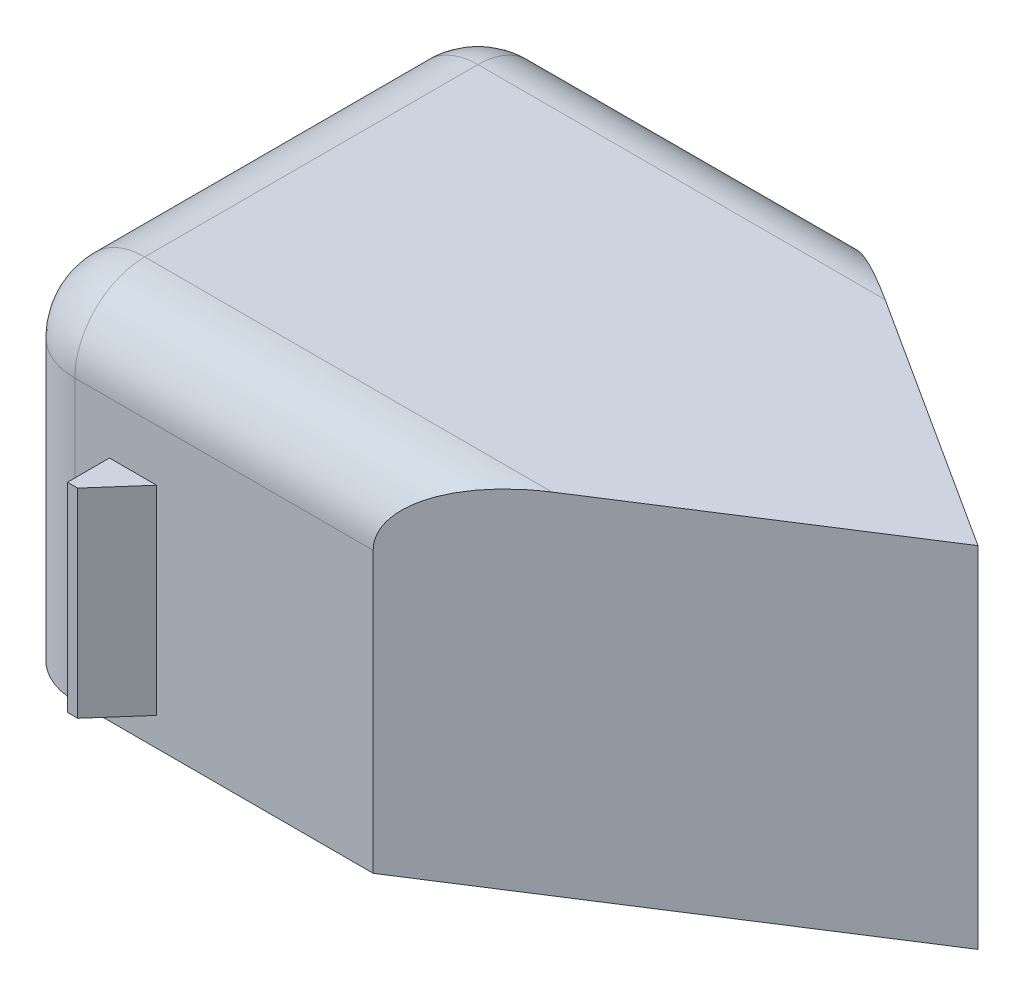
ISO-10303-21;
HEADER;
FILE_DESCRIPTION(('STEP AP214'),'2;1');
FILE_NAME('part.step','',(''),(''),'','','');
FILE_SCHEMA(('AUTOMOTIVE_DESIGN { 1 0 10303 214 1 1 1 1 }'));
ENDSEC;
DATA;
#1=APPLICATION_CONTEXT('core data for automotive mechanical design processes');
#2=APPLICATION_PROTOCOL_DEFINITION('international standard','automotive_design',2000,#1);
#3=PRODUCT_CONTEXT('',#1,'mechanical');
#4=PRODUCT('Part','Part','',(#3));
#5=PRODUCT_RELATED_PRODUCT_CATEGORY('part','',(#4));
#6=PRODUCT_DEFINITION_FORMATION('','',#4);
#7=PRODUCT_DEFINITION_CONTEXT('part definition',#1,'design');
#8=PRODUCT_DEFINITION('design','',#6,#7);
#9=PRODUCT_DEFINITION_SHAPE('','',#8);
#10=(LENGTH_UNIT() NAMED_UNIT(*) SI_UNIT(.MILLI.,.METRE.));
#11=(NAMED_UNIT(*) PLANE_ANGLE_UNIT() SI_UNIT($,.RADIAN.));
#12=(NAMED_UNIT(*) SI_UNIT($,.STERADIAN.) SOLID_ANGLE_UNIT());
#13=UNCERTAINTY_MEASURE_WITH_UNIT(LENGTH_MEASURE(1.E-05),#10,'distance_accuracy_value','');
#14=(GEOMETRIC_REPRESENTATION_CONTEXT(3) GLOBAL_UNCERTAINTY_ASSIGNED_CONTEXT((#13)) GLOBAL_UNIT_ASSIGNED_CONTEXT((#10,
#11,#12)) REPRESENTATION_CONTEXT('',''));
#15=CARTESIAN_POINT('',(0.,0.,0.));
#16=DIRECTION('',(0.,0.,1.));
#17=DIRECTION('',(1.,0.,0.));
#18=AXIS2_PLACEMENT_3D('',#15,#16,#17);
#19=CARTESIAN_POINT('',(0.,50.,33.8164124847404));
#20=DIRECTION('',(0.,0.,1.));
#21=DIRECTION('',(1.,0.,0.));
#22=AXIS2_PLACEMENT_3D('',#19,#20,#21);
#23=PLANE('',#22);
#24=DIRECTION('',(-1.,0.,0.));
#25=VECTOR('',#24,1.);
#26=CARTESIAN_POINT('',(-30.9724843314032,32.5747923636586,33.8164124847404));
#27=LINE('',#26,#25);
#28=CARTESIAN_POINT('',(-30.9724843314032,32.5747923636586,33.8164124847404));
#29=VERTEX_POINT('',#28);
#30=CARTESIAN_POINT('',(-37.7056330990995,32.5747923636586,33.8164124847404));
#31=VERTEX_POINT('',#30);
#32=EDGE_CURVE('E162',#29,#31,#27,.T.);
#33=ORIENTED_EDGE('',*,*,#32,.F.);
#34=DIRECTION('',(0.,1.,0.));
#35=VECTOR('',#34,1.);
#36=CARTESIAN_POINT('',(-30.9724843314032,4.07112924707744,33.8164124847404));
#37=LINE('',#36,#35);
#38=CARTESIAN_POINT('',(-30.9724843314032,4.07112924707744,33.8164124847404));
#39=VERTEX_POINT('',#38);
#40=EDGE_CURVE('E172',#39,#29,#37,.T.);
#41=ORIENTED_EDGE('',*,*,#40,.F.);
#42=DIRECTION('',(1.,0.,0.));
#43=VECTOR('',#42,1.);
#44=CARTESIAN_POINT('',(-30.9724843314032,4.07112924707744,33.8164124847404));
#45=LINE('',#44,#43);
#46=CARTESIAN_POINT('',(-37.7056330990995,4.07112924707744,33.8164124847404));
#47=VERTEX_POINT('',#46);
#48=EDGE_CURVE('E147',#47,#39,#45,.T.);
#49=ORIENTED_EDGE('',*,*,#48,.F.);
#50=DIRECTION('',(0.,-1.,0.));
#51=VECTOR('',#50,1.);
#52=CARTESIAN_POINT('',(-37.7056330990995,4.07112924707744,33.8164124847404));
#53=LINE('',#52,#51);
#54=EDGE_CURVE('E166',#31,#47,#53,.T.);
#55=ORIENTED_EDGE('',*,*,#54,.F.);
#56=EDGE_LOOP('',(#33,#41,#49,#55));
#57=FACE_BOUND('',#56,.T.);
#58=DIRECTION('',(0.,-1.,0.));
#59=VECTOR('',#58,1.);
#60=CARTESIAN_POINT('',(0.,50.,33.8164124847404));
#61=LINE('',#60,#59);
#62=CARTESIAN_POINT('',(0.,40.,33.8164124847404));
#63=VERTEX_POINT('',#62);
#64=CARTESIAN_POINT('',(0.,0.,33.8164124847404));
#65=VERTEX_POINT('',#64);
#66=EDGE_CURVE('E223',#63,#65,#61,.T.);
#67=ORIENTED_EDGE('',*,*,#66,.F.);
#68=DIRECTION('',(-1.,0.,0.));
#69=VECTOR('',#68,1.);
#70=CARTESIAN_POINT('',(-42.6627135137854,40.,33.8164124847404));
#71=LINE('',#70,#69);
#72=CARTESIAN_POINT('',(-42.6627135137854,40.,33.8164124847404));
#73=VERTEX_POINT('',#72);
#74=EDGE_CURVE('E241',#63,#73,#71,.T.);
#75=ORIENTED_EDGE('',*,*,#74,.T.);
#76=DIRECTION('',(0.,-1.,0.));
#77=VECTOR('',#76,1.);
#78=CARTESIAN_POINT('',(-42.6627135137854,50.,33.8164124847404));
#79=LINE('',#78,#77);
#80=CARTESIAN_POINT('',(-42.6627135137854,0.,33.8164124847404));
#81=VERTEX_POINT('',#80);
#82=EDGE_CURVE('E226',#73,#81,#79,.T.);
#83=ORIENTED_EDGE('',*,*,#82,.T.);
#84=DIRECTION('',(-1.,0.,0.));
#85=VECTOR('',#84,1.);
#86=CARTESIAN_POINT('',(0.,0.,33.8164124847404));
#87=LINE('',#86,#85);
#88=EDGE_CURVE('E214',#65,#81,#87,.T.);
#89=ORIENTED_EDGE('',*,*,#88,.F.);
#90=EDGE_LOOP('',(#67,#75,#83,#89));
#91=FACE_BOUND('',#90,.T.);
#92=ADVANCED_FACE('F43',(#57,#91),#23,.T.);
#93=CARTESIAN_POINT('',(52.6627135137854,50.,0.));
#94=DIRECTION('',(-0.54032575908207,0.,0.841455925210813));
#95=DIRECTION('',(0.841455925210813,0.,0.54032575908207));
#96=AXIS2_PLACEMENT_3D('',#93,#94,#95);
#97=PLANE('',#96);
#98=DIRECTION('',(0.,-1.,0.));
#99=VECTOR('',#98,1.);
#100=CARTESIAN_POINT('',(0.,50.,-33.8164124847404));
#101=LINE('',#100,#99);
#102=CARTESIAN_POINT('',(0.,40.,-33.8164124847404));
#103=VERTEX_POINT('',#102);
#104=CARTESIAN_POINT('',(0.,0.,-33.8164124847404));
#105=VERTEX_POINT('',#104);
#106=EDGE_CURVE('E238',#103,#105,#101,.T.);
#107=ORIENTED_EDGE('',*,*,#106,.F.);
#108=CARTESIAN_POINT('',(15.5731225296443,40.,-23.8164124847404));
#109=DIRECTION('',(-0.54032575908207,0.,0.841455925210813));
#110=DIRECTION('',(-0.841455925210813,0.,-0.54032575908207));
#111=AXIS2_PLACEMENT_3D('',#108,#109,#110);
#112=ELLIPSE('',#111,18.5073538174239,10.);
#113=CARTESIAN_POINT('',(15.5731225296443,50.,-23.8164124847404));
#114=VERTEX_POINT('',#113);
#115=EDGE_CURVE('E263',#103,#114,#112,.F.);
#116=ORIENTED_EDGE('',*,*,#115,.T.);
#117=DIRECTION('',(-0.841455925210813,0.,-0.54032575908207));
#118=VECTOR('',#117,1.);
#119=CARTESIAN_POINT('',(52.6627135137854,50.,0.));
#120=LINE('',#119,#118);
#121=CARTESIAN_POINT('',(52.6627135137854,50.,0.));
#122=VERTEX_POINT('',#121);
#123=EDGE_CURVE('E184',#122,#114,#120,.T.);
#124=ORIENTED_EDGE('',*,*,#123,.F.);
#125=DIRECTION('',(0.,-1.,0.));
#126=VECTOR('',#125,1.);
#127=CARTESIAN_POINT('',(52.6627135137854,50.,0.));
#128=LINE('',#127,#126);
#129=CARTESIAN_POINT('',(52.6627135137854,0.,0.));
#130=VERTEX_POINT('',#129);
#131=EDGE_CURVE('E192',#122,#130,#128,.T.);
#132=ORIENTED_EDGE('',*,*,#131,.T.);
#133=DIRECTION('',(-0.841455925210813,0.,-0.54032575908207));
#134=VECTOR('',#133,1.);
#135=CARTESIAN_POINT('',(52.6627135137854,0.,0.));
#136=LINE('',#135,#134);
#137=EDGE_CURVE('E193',#130,#105,#136,.T.);
#138=ORIENTED_EDGE('',*,*,#137,.T.);
#139=EDGE_LOOP('',(#107,#116,#124,#132,#138));
#140=FACE_BOUND('',#139,.T.);
#141=ADVANCED_FACE('F298',(#140),#97,.F.);
#142=CARTESIAN_POINT('',(0.,50.,-33.8164124847404));
#143=DIRECTION('',(0.,0.,1.));
#144=DIRECTION('',(1.,0.,0.));
#145=AXIS2_PLACEMENT_3D('',#142,#143,#144);
#146=PLANE('',#145);
#147=DIRECTION('',(0.,-1.,0.));
#148=VECTOR('',#147,1.);
#149=CARTESIAN_POINT('',(-42.6627135137854,50.,-33.8164124847404));
#150=LINE('',#149,#148);
#151=CARTESIAN_POINT('',(-42.6627135137854,40.,-33.8164124847404));
#152=VERTEX_POINT('',#151);
#153=CARTESIAN_POINT('',(-42.6627135137854,0.,-33.8164124847404));
#154=VERTEX_POINT('',#153);
#155=EDGE_CURVE('E235',#152,#154,#150,.T.);
#156=ORIENTED_EDGE('',*,*,#155,.F.);
#157=DIRECTION('',(-1.,0.,0.));
#158=VECTOR('',#157,1.);
#159=CARTESIAN_POINT('',(0.,40.,-33.8164124847404));
#160=LINE('',#159,#158);
#161=EDGE_CURVE('E260',#152,#103,#160,.F.);
#162=ORIENTED_EDGE('',*,*,#161,.T.);
#163=ORIENTED_EDGE('',*,*,#106,.T.);
#164=DIRECTION('',(-1.,0.,0.));
#165=VECTOR('',#164,1.);
#166=CARTESIAN_POINT('',(0.,0.,-33.8164124847404));
#167=LINE('',#166,#165);
#168=EDGE_CURVE('E197',#105,#154,#167,.T.);
#169=ORIENTED_EDGE('',*,*,#168,.T.);
#170=EDGE_LOOP('',(#156,#162,#163,#169));
#171=FACE_BOUND('',#170,.T.);
#172=ADVANCED_FACE('F295',(#171),#146,.F.);
#173=CARTESIAN_POINT('',(-42.6627135137854,50.,-23.8164124847404));
#174=DIRECTION('',(0.,-1.,0.));
#175=DIRECTION('',(0.,0.,-1.));
#176=AXIS2_PLACEMENT_3D('',#173,#174,#175);
#177=CYLINDRICAL_SURFACE('',#176,10.);
#178=DIRECTION('',(0.,-1.,0.));
#179=VECTOR('',#178,1.);
#180=CARTESIAN_POINT('',(-52.6627135137854,50.,-23.8164124847403));
#181=LINE('',#180,#179);
#182=CARTESIAN_POINT('',(-52.6627135137854,40.,-23.8164124847403));
#183=VERTEX_POINT('',#182);
#184=CARTESIAN_POINT('',(-52.6627135137854,0.,-23.8164124847403));
#185=VERTEX_POINT('',#184);
#186=EDGE_CURVE('E232',#183,#185,#181,.T.);
#187=ORIENTED_EDGE('',*,*,#186,.F.);
#188=CARTESIAN_POINT('',(-42.6627135137854,40.,-23.8164124847404));
#189=DIRECTION('',(0.,-1.,0.));
#190=DIRECTION('',(0.,0.,-1.));
#191=AXIS2_PLACEMENT_3D('',#188,#189,#190);
#192=CIRCLE('',#191,10.);
#193=EDGE_CURVE('E266',#183,#152,#192,.T.);
#194=ORIENTED_EDGE('',*,*,#193,.T.);
#195=ORIENTED_EDGE('',*,*,#155,.T.);
#196=CARTESIAN_POINT('',(-42.6627135137854,0.,-23.8164124847404));
#197=DIRECTION('',(0.,-1.,0.));
#198=DIRECTION('',(0.,0.,-1.));
#199=AXIS2_PLACEMENT_3D('',#196,#197,#198);
#200=CIRCLE('',#199,10.);
#201=EDGE_CURVE('E202',#185,#154,#200,.T.);
#202=ORIENTED_EDGE('',*,*,#201,.F.);
#203=EDGE_LOOP('',(#187,#194,#195,#202));
#204=FACE_BOUND('',#203,.T.);
#205=ADVANCED_FACE('F310',(#204),#177,.T.);
#206=CARTESIAN_POINT('',(-52.6627135137854,50.,23.8164124847403));
#207=DIRECTION('',(-1.,0.,0.));
#208=DIRECTION('',(0.,0.,1.));
#209=AXIS2_PLACEMENT_3D('',#206,#207,#208);
#210=PLANE('',#209);
#211=DIRECTION('',(0.,-1.,0.));
#212=VECTOR('',#211,1.);
#213=CARTESIAN_POINT('',(-52.6627135137854,50.,23.8164124847403));
#214=LINE('',#213,#212);
#215=CARTESIAN_POINT('',(-52.6627135137854,40.,23.8164124847403));
#216=VERTEX_POINT('',#215);
#217=CARTESIAN_POINT('',(-52.6627135137854,0.,23.8164124847403));
#218=VERTEX_POINT('',#217);
#219=EDGE_CURVE('E229',#216,#218,#214,.T.);
#220=ORIENTED_EDGE('',*,*,#219,.F.);
#221=DIRECTION('',(0.,0.,-1.));
#222=VECTOR('',#221,1.);
#223=CARTESIAN_POINT('',(-52.6627135137854,40.,-23.8164124847403));
#224=LINE('',#223,#222);
#225=EDGE_CURVE('E52',#216,#183,#224,.T.);
#226=ORIENTED_EDGE('',*,*,#225,.T.);
#227=ORIENTED_EDGE('',*,*,#186,.T.);
#228=DIRECTION('',(0.,0.,-1.));
#229=VECTOR('',#228,1.);
#230=CARTESIAN_POINT('',(-52.6627135137854,0.,23.8164124847403));
#231=LINE('',#230,#229);
#232=EDGE_CURVE('E206',#218,#185,#231,.T.);
#233=ORIENTED_EDGE('',*,*,#232,.F.);
#234=EDGE_LOOP('',(#220,#226,#227,#233));
#235=FACE_BOUND('',#234,.T.);
#236=ADVANCED_FACE('F311',(#235),#210,.T.);
#237=CARTESIAN_POINT('',(-42.6627135137854,50.,23.8164124847404));
#238=DIRECTION('',(0.,-1.,0.));
#239=DIRECTION('',(0.,0.,-1.));
#240=AXIS2_PLACEMENT_3D('',#237,#238,#239);
#241=CYLINDRICAL_SURFACE('',#240,10.);
#242=ORIENTED_EDGE('',*,*,#82,.F.);
#243=CARTESIAN_POINT('',(-42.6627135137854,40.,23.8164124847404));
#244=DIRECTION('',(0.,-1.,0.));
#245=DIRECTION('',(0.,0.,-1.));
#246=AXIS2_PLACEMENT_3D('',#243,#244,#245);
#247=CIRCLE('',#246,10.);
#248=EDGE_CURVE('E257',#73,#216,#247,.T.);
#249=ORIENTED_EDGE('',*,*,#248,.T.);
#250=ORIENTED_EDGE('',*,*,#219,.T.);
#251=CARTESIAN_POINT('',(-42.6627135137854,0.,23.8164124847404));
#252=DIRECTION('',(0.,1.,0.));
#253=DIRECTION('',(0.,0.,1.));
#254=AXIS2_PLACEMENT_3D('',#251,#252,#253);
#255=CIRCLE('',#254,10.);
#256=EDGE_CURVE('E210',#218,#81,#255,.T.);
#257=ORIENTED_EDGE('',*,*,#256,.T.);
#258=EDGE_LOOP('',(#242,#249,#250,#257));
#259=FACE_BOUND('',#258,.T.);
#260=ADVANCED_FACE('F333',(#259),#241,.T.);
#261=CARTESIAN_POINT('',(0.,50.,33.8164124847404));
#262=DIRECTION('',(-0.54032575908207,0.,-0.841455925210813));
#263=DIRECTION('',(-0.841455925210813,0.,0.54032575908207));
#264=AXIS2_PLACEMENT_3D('',#261,#262,#263);
#265=PLANE('',#264);
#266=DIRECTION('',(0.841455925210813,0.,-0.54032575908207));
#267=VECTOR('',#266,1.);
#268=CARTESIAN_POINT('',(0.,50.,33.8164124847404));
#269=LINE('',#268,#267);
#270=CARTESIAN_POINT('',(15.5731225296443,50.,23.8164124847404));
#271=VERTEX_POINT('',#270);
#272=EDGE_CURVE('E188',#271,#122,#269,.T.);
#273=ORIENTED_EDGE('',*,*,#272,.F.);
#274=CARTESIAN_POINT('',(15.5731225296443,40.,23.8164124847404));
#275=DIRECTION('',(-0.54032575908207,0.,-0.841455925210813));
#276=DIRECTION('',(0.841455925210813,0.,-0.54032575908207));
#277=AXIS2_PLACEMENT_3D('',#274,#275,#276);
#278=ELLIPSE('',#277,18.5073538174239,10.);
#279=EDGE_CURVE('E254',#271,#63,#278,.F.);
#280=ORIENTED_EDGE('',*,*,#279,.T.);
#281=ORIENTED_EDGE('',*,*,#66,.T.);
#282=DIRECTION('',(0.841455925210813,0.,-0.54032575908207));
#283=VECTOR('',#282,1.);
#284=CARTESIAN_POINT('',(0.,0.,33.8164124847404));
#285=LINE('',#284,#283);
#286=EDGE_CURVE('E189',#65,#130,#285,.T.);
#287=ORIENTED_EDGE('',*,*,#286,.T.);
#288=ORIENTED_EDGE('',*,*,#131,.F.);
#289=EDGE_LOOP('',(#273,#280,#281,#287,#288));
#290=FACE_BOUND('',#289,.T.);
#291=ADVANCED_FACE('F329',(#290),#265,.F.);
#292=CARTESIAN_POINT('',(-42.6627135137854,50.,-23.8164124847404));
#293=DIRECTION('',(0.,-1.,0.));
#294=DIRECTION('',(0.,0.,-1.));
#295=AXIS2_PLACEMENT_3D('',#292,#293,#294);
#296=PLANE('',#295);
#297=DIRECTION('',(0.,0.,-1.));
#298=VECTOR('',#297,1.);
#299=CARTESIAN_POINT('',(-42.6627135137854,50.,23.8164124847403));
#300=LINE('',#299,#298);
#301=CARTESIAN_POINT('',(-42.6627135137854,50.,-23.8164124847404));
#302=VERTEX_POINT('',#301);
#303=CARTESIAN_POINT('',(-42.6627135137854,50.,23.8164124847404));
#304=VERTEX_POINT('',#303);
#305=EDGE_CURVE('E245',#302,#304,#300,.F.);
#306=ORIENTED_EDGE('',*,*,#305,.T.);
#307=DIRECTION('',(-1.,0.,0.));
#308=VECTOR('',#307,1.);
#309=CARTESIAN_POINT('',(0.,50.,23.8164124847404));
#310=LINE('',#309,#308);
#311=EDGE_CURVE('E251',#304,#271,#310,.F.);
#312=ORIENTED_EDGE('',*,*,#311,.T.);
#313=ORIENTED_EDGE('',*,*,#272,.T.);
#314=ORIENTED_EDGE('',*,*,#123,.T.);
#315=DIRECTION('',(-1.,0.,0.));
#316=VECTOR('',#315,1.);
#317=CARTESIAN_POINT('',(-42.6627135137854,50.,-23.8164124847404));
#318=LINE('',#317,#316);
#319=EDGE_CURVE('E248',#114,#302,#318,.T.);
#320=ORIENTED_EDGE('',*,*,#319,.T.);
#321=EDGE_LOOP('',(#306,#312,#313,#314,#320));
#322=FACE_BOUND('',#321,.T.);
#323=ADVANCED_FACE('F327',(#322),#296,.F.);
#324=CARTESIAN_POINT('',(-42.6627135137854,0.,-23.8164124847404));
#325=DIRECTION('',(0.,-1.,0.));
#326=DIRECTION('',(0.,0.,-1.));
#327=AXIS2_PLACEMENT_3D('',#324,#325,#326);
#328=PLANE('',#327);
#329=ORIENTED_EDGE('',*,*,#137,.F.);
#330=ORIENTED_EDGE('',*,*,#286,.F.);
#331=ORIENTED_EDGE('',*,*,#88,.T.);
#332=ORIENTED_EDGE('',*,*,#256,.F.);
#333=ORIENTED_EDGE('',*,*,#232,.T.);
#334=ORIENTED_EDGE('',*,*,#201,.T.);
#335=ORIENTED_EDGE('',*,*,#168,.F.);
#336=EDGE_LOOP('',(#329,#330,#331,#332,#333,#334,#335));
#337=FACE_BOUND('',#336,.T.);
#338=ADVANCED_FACE('F304',(#337),#328,.T.);
#339=CARTESIAN_POINT('',(-42.6627135137854,40.,-23.8164124847404));
#340=DIRECTION('',(-1.,0.,0.));
#341=DIRECTION('',(0.,0.,1.));
#342=AXIS2_PLACEMENT_3D('',#339,#340,#341);
#343=CYLINDRICAL_SURFACE('',#342,10.);
#344=ORIENTED_EDGE('',*,*,#115,.F.);
#345=ORIENTED_EDGE('',*,*,#161,.F.);
#346=CARTESIAN_POINT('',(-42.6627135137854,40.,-23.8164124847404));
#347=DIRECTION('',(-1.,0.,0.));
#348=DIRECTION('',(0.,0.,1.));
#349=AXIS2_PLACEMENT_3D('',#346,#347,#348);
#350=CIRCLE('',#349,10.);
#351=EDGE_CURVE('E198',#302,#152,#350,.T.);
#352=ORIENTED_EDGE('',*,*,#351,.F.);
#353=ORIENTED_EDGE('',*,*,#319,.F.);
#354=EDGE_LOOP('',(#344,#345,#352,#353));
#355=FACE_BOUND('',#354,.T.);
#356=ADVANCED_FACE('F45',(#355),#343,.T.);
#357=CARTESIAN_POINT('',(-42.6627135137854,40.,-23.8164124847404));
#358=DIRECTION('',(0.,-1.,0.));
#359=DIRECTION('',(0.,0.,-1.));
#360=AXIS2_PLACEMENT_3D('',#357,#358,#359);
#361=SPHERICAL_SURFACE('',#360,10.);
#362=ORIENTED_EDGE('',*,*,#351,.T.);
#363=ORIENTED_EDGE('',*,*,#193,.F.);
#364=CARTESIAN_POINT('',(-42.6627135137854,40.,-23.8164124847404));
#365=DIRECTION('',(0.,0.,1.));
#366=DIRECTION('',(1.,0.,0.));
#367=AXIS2_PLACEMENT_3D('',#364,#365,#366);
#368=CIRCLE('',#367,10.);
#369=EDGE_CURVE('E277',#302,#183,#368,.T.);
#370=ORIENTED_EDGE('',*,*,#369,.F.);
#371=EDGE_LOOP('',(#362,#363,#370));
#372=FACE_BOUND('',#371,.T.);
#373=ADVANCED_FACE('F286',(#372),#361,.T.);
#374=CARTESIAN_POINT('',(-42.6627135137854,40.,23.8164124847403));
#375=DIRECTION('',(0.,0.,1.));
#376=DIRECTION('',(1.,0.,0.));
#377=AXIS2_PLACEMENT_3D('',#374,#375,#376);
#378=CYLINDRICAL_SURFACE('',#377,10.);
#379=ORIENTED_EDGE('',*,*,#369,.T.);
#380=ORIENTED_EDGE('',*,*,#225,.F.);
#381=CARTESIAN_POINT('',(-42.6627135137854,40.,23.8164124847404));
#382=DIRECTION('',(0.,0.,1.));
#383=DIRECTION('',(1.,0.,0.));
#384=AXIS2_PLACEMENT_3D('',#381,#382,#383);
#385=CIRCLE('',#384,10.);
#386=EDGE_CURVE('E273',#304,#216,#385,.T.);
#387=ORIENTED_EDGE('',*,*,#386,.F.);
#388=ORIENTED_EDGE('',*,*,#305,.F.);
#389=EDGE_LOOP('',(#379,#380,#387,#388));
#390=FACE_BOUND('',#389,.T.);
#391=ADVANCED_FACE('F315',(#390),#378,.T.);
#392=CARTESIAN_POINT('',(-42.6627135137854,40.,23.8164124847404));
#393=DIRECTION('',(0.,-1.,0.));
#394=DIRECTION('',(0.,0.,-1.));
#395=AXIS2_PLACEMENT_3D('',#392,#393,#394);
#396=SPHERICAL_SURFACE('',#395,10.);
#397=ORIENTED_EDGE('',*,*,#386,.T.);
#398=ORIENTED_EDGE('',*,*,#248,.F.);
#399=CARTESIAN_POINT('',(-42.6627135137854,40.,23.8164124847404));
#400=DIRECTION('',(1.,0.,0.));
#401=DIRECTION('',(0.,0.,-1.));
#402=AXIS2_PLACEMENT_3D('',#399,#400,#401);
#403=CIRCLE('',#402,10.);
#404=EDGE_CURVE('E183',#304,#73,#403,.T.);
#405=ORIENTED_EDGE('',*,*,#404,.F.);
#406=EDGE_LOOP('',(#397,#398,#405));
#407=FACE_BOUND('',#406,.T.);
#408=ADVANCED_FACE('F320',(#407),#396,.T.);
#409=CARTESIAN_POINT('',(0.,40.,23.8164124847404));
#410=DIRECTION('',(1.,0.,0.));
#411=DIRECTION('',(0.,0.,-1.));
#412=AXIS2_PLACEMENT_3D('',#409,#410,#411);
#413=CYLINDRICAL_SURFACE('',#412,10.);
#414=ORIENTED_EDGE('',*,*,#279,.F.);
#415=ORIENTED_EDGE('',*,*,#311,.F.);
#416=ORIENTED_EDGE('',*,*,#404,.T.);
#417=ORIENTED_EDGE('',*,*,#74,.F.);
#418=EDGE_LOOP('',(#414,#415,#416,#417));
#419=FACE_BOUND('',#418,.T.);
#420=ADVANCED_FACE('F324',(#419),#413,.T.);
#421=CARTESIAN_POINT('',(-37.7056330990995,4.07112924707744,39.8164124847404));
#422=DIRECTION('',(1.,0.,0.));
#423=DIRECTION('',(0.,0.,-1.));
#424=AXIS2_PLACEMENT_3D('',#421,#422,#423);
#425=PLANE('',#424);
#426=ORIENTED_EDGE('',*,*,#54,.T.);
#427=DIRECTION('',(0.,0.,-1.));
#428=VECTOR('',#427,1.);
#429=CARTESIAN_POINT('',(-37.7056330990995,4.07112924707744,39.8164124847404));
#430=LINE('',#429,#428);
#431=CARTESIAN_POINT('',(-37.7056330990995,4.07112924707744,39.8164124847404));
#432=VERTEX_POINT('',#431);
#433=EDGE_CURVE('E180',#432,#47,#430,.T.);
#434=ORIENTED_EDGE('',*,*,#433,.F.);
#435=DIRECTION('',(0.,-1.,0.));
#436=VECTOR('',#435,1.);
#437=CARTESIAN_POINT('',(-37.7056330990995,4.07112924707744,39.8164124847404));
#438=LINE('',#437,#436);
#439=CARTESIAN_POINT('',(-37.7056330990995,32.5747923636586,39.8164124847404));
#440=VERTEX_POINT('',#439);
#441=EDGE_CURVE('E153',#440,#432,#438,.T.);
#442=ORIENTED_EDGE('',*,*,#441,.F.);
#443=DIRECTION('',(0.,0.,-1.));
#444=VECTOR('',#443,1.);
#445=CARTESIAN_POINT('',(-37.7056330990995,32.5747923636586,39.8164124847404));
#446=LINE('',#445,#444);
#447=EDGE_CURVE('E160',#440,#31,#446,.T.);
#448=ORIENTED_EDGE('',*,*,#447,.T.);
#449=EDGE_LOOP('',(#426,#434,#442,#448));
#450=FACE_BOUND('',#449,.T.);
#451=ADVANCED_FACE('F355',(#450),#425,.F.);
#452=CARTESIAN_POINT('',(-30.9724843314032,4.07112924707744,39.8164124847404));
#453=DIRECTION('',(0.,1.,0.));
#454=DIRECTION('',(0.,0.,1.));
#455=AXIS2_PLACEMENT_3D('',#452,#453,#454);
#456=PLANE('',#455);
#457=ORIENTED_EDGE('',*,*,#48,.T.);
#458=DIRECTION('',(0.660225675208535,0.,-0.751067279140447));
#459=VECTOR('',#458,1.);
#460=CARTESIAN_POINT('',(-30.9724843314032,4.07112924707744,33.8164124847404));
#461=LINE('',#460,#459);
#462=CARTESIAN_POINT('',(-36.246784199432,4.07112924707744,39.8164124847404));
#463=VERTEX_POINT('',#462);
#464=EDGE_CURVE('E137',#463,#39,#461,.T.);
#465=ORIENTED_EDGE('',*,*,#464,.F.);
#466=DIRECTION('',(1.,0.,0.));
#467=VECTOR('',#466,1.);
#468=CARTESIAN_POINT('',(-30.9724843314032,4.07112924707744,39.8164124847404));
#469=LINE('',#468,#467);
#470=EDGE_CURVE('E144',#432,#463,#469,.T.);
#471=ORIENTED_EDGE('',*,*,#470,.F.);
#472=ORIENTED_EDGE('',*,*,#433,.T.);
#473=EDGE_LOOP('',(#457,#465,#471,#472));
#474=FACE_BOUND('',#473,.T.);
#475=ADVANCED_FACE('F143',(#474),#456,.F.);
#476=CARTESIAN_POINT('',(-30.9724843314032,32.5747923636586,39.8164124847404));
#477=DIRECTION('',(0.,-1.,0.));
#478=DIRECTION('',(0.,0.,-1.));
#479=AXIS2_PLACEMENT_3D('',#476,#477,#478);
#480=PLANE('',#479);
#481=DIRECTION('',(-1.,0.,0.));
#482=VECTOR('',#481,1.);
#483=CARTESIAN_POINT('',(-30.9724843314032,32.5747923636586,39.8164124847404));
#484=LINE('',#483,#482);
#485=CARTESIAN_POINT('',(-36.246784199432,32.5747923636586,39.8164124847404));
#486=VERTEX_POINT('',#485);
#487=EDGE_CURVE('E156',#486,#440,#484,.T.);
#488=ORIENTED_EDGE('',*,*,#487,.F.);
#489=DIRECTION('',(0.660225675208535,0.,-0.751067279140447));
#490=VECTOR('',#489,1.);
#491=CARTESIAN_POINT('',(-33.9477277403884,32.5747923636586,37.201024831513));
#492=LINE('',#491,#490);
#493=EDGE_CURVE('E58',#486,#29,#492,.T.);
#494=ORIENTED_EDGE('',*,*,#493,.T.);
#495=ORIENTED_EDGE('',*,*,#32,.T.);
#496=ORIENTED_EDGE('',*,*,#447,.F.);
#497=EDGE_LOOP('',(#488,#494,#495,#496));
#498=FACE_BOUND('',#497,.T.);
#499=ADVANCED_FACE('F361',(#498),#480,.F.);
#500=CARTESIAN_POINT('',(0.,0.,39.8164124847404));
#501=DIRECTION('',(0.,0.,1.));
#502=DIRECTION('',(1.,0.,0.));
#503=AXIS2_PLACEMENT_3D('',#500,#501,#502);
#504=PLANE('',#503);
#505=DIRECTION('',(0.,-1.,0.));
#506=VECTOR('',#505,1.);
#507=CARTESIAN_POINT('',(-36.246784199432,0.,39.8164124847404));
#508=LINE('',#507,#506);
#509=EDGE_CURVE('E11',#486,#463,#508,.T.);
#510=ORIENTED_EDGE('',*,*,#509,.F.);
#511=ORIENTED_EDGE('',*,*,#487,.T.);
#512=ORIENTED_EDGE('',*,*,#441,.T.);
#513=ORIENTED_EDGE('',*,*,#470,.T.);
#514=EDGE_LOOP('',(#510,#511,#512,#513));
#515=FACE_BOUND('',#514,.T.);
#516=ADVANCED_FACE('F151',(#515),#504,.T.);
#517=CARTESIAN_POINT('',(-30.9724843314032,33.0711292470775,33.8164124847404));
#518=DIRECTION('',(-0.751067279140447,0.,-0.660225675208535));
#519=DIRECTION('',(-0.660225675208535,0.,0.751067279140447));
#520=AXIS2_PLACEMENT_3D('',#517,#518,#519);
#521=PLANE('',#520);
#522=ORIENTED_EDGE('',*,*,#509,.T.);
#523=ORIENTED_EDGE('',*,*,#464,.T.);
#524=ORIENTED_EDGE('',*,*,#40,.T.);
#525=ORIENTED_EDGE('',*,*,#493,.F.);
#526=EDGE_LOOP('',(#522,#523,#524,#525));
#527=FACE_BOUND('',#526,.T.);
#528=ADVANCED_FACE('F136',(#527),#521,.F.);
#529=CLOSED_SHELL('',(#92,#141,#172,#205,#236,#260,#291,#323,#338,#356,#373,#391,#408,#420,#451,
#475,#499,#516,#528));
#530=MANIFOLD_SOLID_BREP('B2',#529);
#531=ADVANCED_BREP_SHAPE_REPRESENTATION('',(#18,#530),#14);
#532=SHAPE_DEFINITION_REPRESENTATION(#9,#531);
ENDSEC;
END-ISO-10303-21;
